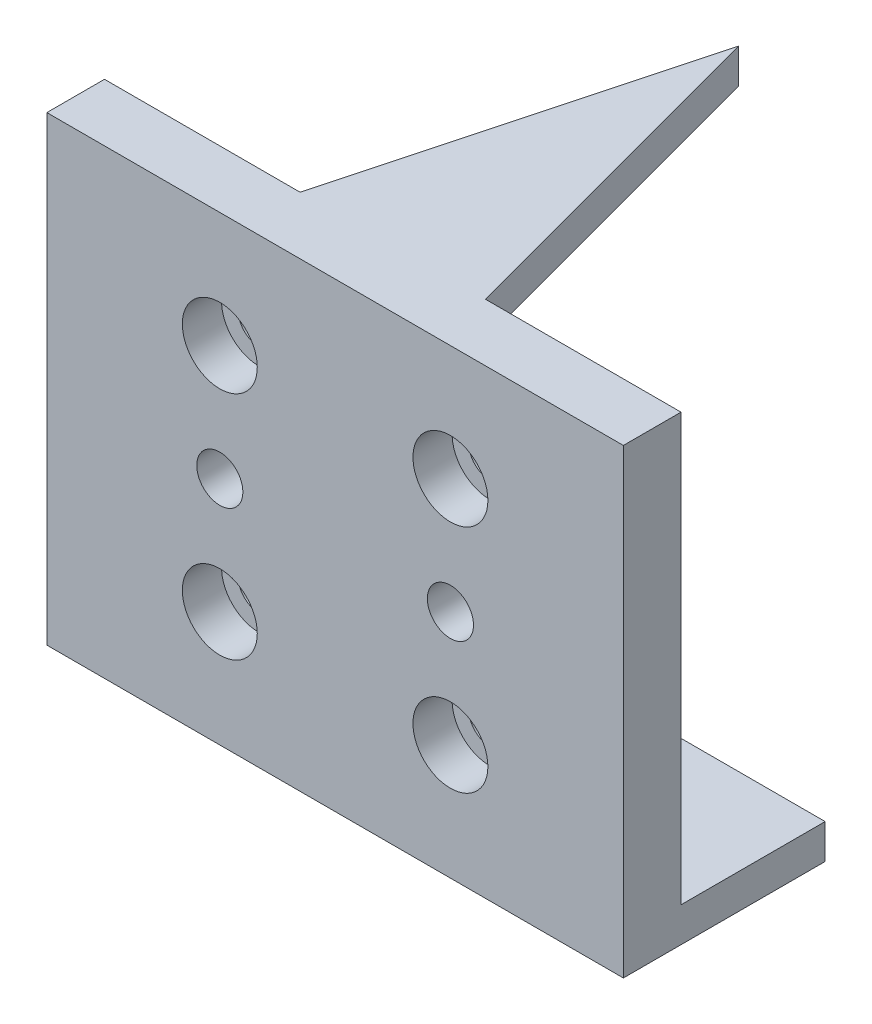
ISO-10303-21;
HEADER;
FILE_DESCRIPTION(('STEP AP214'),'2;1');
FILE_NAME('part.step','',(''),(''),'','','');
FILE_SCHEMA(('AUTOMOTIVE_DESIGN { 1 0 10303 214 1 1 1 1 }'));
ENDSEC;
DATA;
#1=APPLICATION_CONTEXT('core data for automotive mechanical design processes');
#2=APPLICATION_PROTOCOL_DEFINITION('international standard','automotive_design',2000,#1);
#3=PRODUCT_CONTEXT('',#1,'mechanical');
#4=PRODUCT('Part','Part','',(#3));
#5=PRODUCT_RELATED_PRODUCT_CATEGORY('part','',(#4));
#6=PRODUCT_DEFINITION_FORMATION('','',#4);
#7=PRODUCT_DEFINITION_CONTEXT('part definition',#1,'design');
#8=PRODUCT_DEFINITION('design','',#6,#7);
#9=PRODUCT_DEFINITION_SHAPE('','',#8);
#10=(LENGTH_UNIT() NAMED_UNIT(*) SI_UNIT(.MILLI.,.METRE.));
#11=(NAMED_UNIT(*) PLANE_ANGLE_UNIT() SI_UNIT($,.RADIAN.));
#12=(NAMED_UNIT(*) SI_UNIT($,.STERADIAN.) SOLID_ANGLE_UNIT());
#13=UNCERTAINTY_MEASURE_WITH_UNIT(LENGTH_MEASURE(1.E-05),#10,'distance_accuracy_value','');
#14=(GEOMETRIC_REPRESENTATION_CONTEXT(3) GLOBAL_UNCERTAINTY_ASSIGNED_CONTEXT((#13)) GLOBAL_UNIT_ASSIGNED_CONTEXT((#10,
#11,#12)) REPRESENTATION_CONTEXT('',''));
#15=CARTESIAN_POINT('',(0.,0.,0.));
#16=DIRECTION('',(0.,0.,1.));
#17=DIRECTION('',(1.,0.,0.));
#18=AXIS2_PLACEMENT_3D('',#15,#16,#17);
#19=CARTESIAN_POINT('',(0.,0.,0.));
#20=DIRECTION('',(0.,0.,1.));
#21=DIRECTION('',(1.,0.,0.));
#22=AXIS2_PLACEMENT_3D('',#19,#20,#21);
#23=PLANE('',#22);
#24=CARTESIAN_POINT('',(15.,-30.,0.));
#25=DIRECTION('',(0.,0.,1.));
#26=DIRECTION('',(1.,0.,0.));
#27=AXIS2_PLACEMENT_3D('',#24,#25,#26);
#28=CIRCLE('',#27,1.8);
#29=CARTESIAN_POINT('',(16.8,-30.,0.));
#30=VERTEX_POINT('',#29);
#31=EDGE_CURVE('E228',#30,#30,#28,.T.);
#32=ORIENTED_EDGE('',*,*,#31,.T.);
#33=EDGE_LOOP('',(#32));
#34=FACE_BOUND('',#33,.T.);
#35=CARTESIAN_POINT('',(35.,-30.,0.));
#36=DIRECTION('',(0.,0.,1.));
#37=DIRECTION('',(1.,0.,0.));
#38=AXIS2_PLACEMENT_3D('',#35,#36,#37);
#39=CIRCLE('',#38,1.8);
#40=CARTESIAN_POINT('',(36.8,-30.,0.));
#41=VERTEX_POINT('',#40);
#42=EDGE_CURVE('E212',#41,#41,#39,.T.);
#43=ORIENTED_EDGE('',*,*,#42,.T.);
#44=EDGE_LOOP('',(#43));
#45=FACE_BOUND('',#44,.T.);
#46=CARTESIAN_POINT('',(35.,-10.,0.));
#47=DIRECTION('',(0.,0.,1.));
#48=DIRECTION('',(1.,0.,0.));
#49=AXIS2_PLACEMENT_3D('',#46,#47,#48);
#50=CIRCLE('',#49,1.8);
#51=CARTESIAN_POINT('',(36.8,-10.,0.));
#52=VERTEX_POINT('',#51);
#53=EDGE_CURVE('E196',#52,#52,#50,.T.);
#54=ORIENTED_EDGE('',*,*,#53,.T.);
#55=EDGE_LOOP('',(#54));
#56=FACE_BOUND('',#55,.T.);
#57=CARTESIAN_POINT('',(15.,-9.99999999999999,0.));
#58=DIRECTION('',(0.,0.,1.));
#59=DIRECTION('',(1.,0.,0.));
#60=AXIS2_PLACEMENT_3D('',#57,#58,#59);
#61=CIRCLE('',#60,1.8);
#62=CARTESIAN_POINT('',(16.8,-9.99999999999999,0.));
#63=VERTEX_POINT('',#62);
#64=EDGE_CURVE('E180',#63,#63,#61,.T.);
#65=ORIENTED_EDGE('',*,*,#64,.T.);
#66=EDGE_LOOP('',(#65));
#67=FACE_BOUND('',#66,.T.);
#68=CARTESIAN_POINT('',(35.,-20.,0.));
#69=DIRECTION('',(0.,0.,1.));
#70=DIRECTION('',(1.,0.,0.));
#71=AXIS2_PLACEMENT_3D('',#68,#69,#70);
#72=CIRCLE('',#71,2.);
#73=CARTESIAN_POINT('',(37.,-20.,0.));
#74=VERTEX_POINT('',#73);
#75=EDGE_CURVE('E157',#74,#74,#72,.T.);
#76=ORIENTED_EDGE('',*,*,#75,.T.);
#77=EDGE_LOOP('',(#76));
#78=FACE_BOUND('',#77,.T.);
#79=CARTESIAN_POINT('',(15.,-20.,0.));
#80=DIRECTION('',(0.,0.,1.));
#81=DIRECTION('',(1.,0.,0.));
#82=AXIS2_PLACEMENT_3D('',#79,#80,#81);
#83=CIRCLE('',#82,2.);
#84=CARTESIAN_POINT('',(17.,-20.,0.));
#85=VERTEX_POINT('',#84);
#86=EDGE_CURVE('E164',#85,#85,#83,.T.);
#87=ORIENTED_EDGE('',*,*,#86,.T.);
#88=EDGE_LOOP('',(#87));
#89=FACE_BOUND('',#88,.T.);
#90=DIRECTION('',(1.,0.,0.));
#91=VECTOR('',#90,1.);
#92=CARTESIAN_POINT('',(50.,-37.,0.));
#93=LINE('',#92,#91);
#94=CARTESIAN_POINT('',(0.,-37.,0.));
#95=VERTEX_POINT('',#94);
#96=CARTESIAN_POINT('',(50.,-37.,0.));
#97=VERTEX_POINT('',#96);
#98=EDGE_CURVE('E138',#95,#97,#93,.T.);
#99=ORIENTED_EDGE('',*,*,#98,.F.);
#100=DIRECTION('',(0.,-1.,0.));
#101=VECTOR('',#100,1.);
#102=CARTESIAN_POINT('',(0.,0.,0.));
#103=LINE('',#102,#101);
#104=CARTESIAN_POINT('',(0.,0.,0.));
#105=VERTEX_POINT('',#104);
#106=EDGE_CURVE('E253',#105,#95,#103,.T.);
#107=ORIENTED_EDGE('',*,*,#106,.F.);
#108=DIRECTION('',(-1.,0.,0.));
#109=VECTOR('',#108,1.);
#110=CARTESIAN_POINT('',(0.,0.,0.));
#111=LINE('',#110,#109);
#112=CARTESIAN_POINT('',(16.9615242270666,0.,0.));
#113=VERTEX_POINT('',#112);
#114=EDGE_CURVE('E279',#113,#105,#111,.T.);
#115=ORIENTED_EDGE('',*,*,#114,.F.);
#116=DIRECTION('',(0.,1.,0.));
#117=VECTOR('',#116,1.);
#118=CARTESIAN_POINT('',(16.9615242270666,-3.,0.));
#119=LINE('',#118,#117);
#120=CARTESIAN_POINT('',(16.9615242270666,-3.,0.));
#121=VERTEX_POINT('',#120);
#122=EDGE_CURVE('E254',#121,#113,#119,.T.);
#123=ORIENTED_EDGE('',*,*,#122,.F.);
#124=DIRECTION('',(1.,0.,0.));
#125=VECTOR('',#124,1.);
#126=CARTESIAN_POINT('',(33.038475772934,-3.,0.));
#127=LINE('',#126,#125);
#128=CARTESIAN_POINT('',(33.038475772934,-3.,0.));
#129=VERTEX_POINT('',#128);
#130=EDGE_CURVE('E240',#121,#129,#127,.T.);
#131=ORIENTED_EDGE('',*,*,#130,.T.);
#132=DIRECTION('',(0.,1.,0.));
#133=VECTOR('',#132,1.);
#134=CARTESIAN_POINT('',(33.038475772934,-3.,0.));
#135=LINE('',#134,#133);
#136=CARTESIAN_POINT('',(33.038475772934,0.,0.));
#137=VERTEX_POINT('',#136);
#138=EDGE_CURVE('E250',#129,#137,#135,.T.);
#139=ORIENTED_EDGE('',*,*,#138,.T.);
#140=CARTESIAN_POINT('',(50.,0.,0.));
#141=VERTEX_POINT('',#140);
#142=EDGE_CURVE('E264',#141,#137,#111,.T.);
#143=ORIENTED_EDGE('',*,*,#142,.F.);
#144=DIRECTION('',(0.,1.,0.));
#145=VECTOR('',#144,1.);
#146=CARTESIAN_POINT('',(50.,0.,0.));
#147=LINE('',#146,#145);
#148=EDGE_CURVE('E276',#97,#141,#147,.T.);
#149=ORIENTED_EDGE('',*,*,#148,.F.);
#150=EDGE_LOOP('',(#99,#107,#115,#123,#131,#139,#143,#149));
#151=FACE_BOUND('',#150,.T.);
#152=ADVANCED_FACE('F45',(#34,#45,#56,#67,#78,#89,#151),#23,.F.);
#153=CARTESIAN_POINT('',(0.,0.,5.));
#154=DIRECTION('',(1.,0.,0.));
#155=DIRECTION('',(0.,1.,0.));
#156=AXIS2_PLACEMENT_3D('',#153,#154,#155);
#157=PLANE('',#156);
#158=ORIENTED_EDGE('',*,*,#106,.T.);
#159=DIRECTION('',(0.,0.,1.));
#160=VECTOR('',#159,1.);
#161=CARTESIAN_POINT('',(0.,-37.,-12.5));
#162=LINE('',#161,#160);
#163=CARTESIAN_POINT('',(0.,-37.,-12.5));
#164=VERTEX_POINT('',#163);
#165=EDGE_CURVE('E149',#164,#95,#162,.T.);
#166=ORIENTED_EDGE('',*,*,#165,.F.);
#167=DIRECTION('',(0.,1.,0.));
#168=VECTOR('',#167,1.);
#169=CARTESIAN_POINT('',(0.,-40.,-12.5));
#170=LINE('',#169,#168);
#171=CARTESIAN_POINT('',(0.,-40.,-12.5));
#172=VERTEX_POINT('',#171);
#173=EDGE_CURVE('E132',#172,#164,#170,.T.);
#174=ORIENTED_EDGE('',*,*,#173,.F.);
#175=DIRECTION('',(0.,0.,-1.));
#176=VECTOR('',#175,1.);
#177=CARTESIAN_POINT('',(0.,-40.,5.));
#178=LINE('',#177,#176);
#179=CARTESIAN_POINT('',(0.,-40.,5.));
#180=VERTEX_POINT('',#179);
#181=EDGE_CURVE('E11',#180,#172,#178,.T.);
#182=ORIENTED_EDGE('',*,*,#181,.F.);
#183=DIRECTION('',(0.,-1.,0.));
#184=VECTOR('',#183,1.);
#185=CARTESIAN_POINT('',(0.,0.,5.));
#186=LINE('',#185,#184);
#187=CARTESIAN_POINT('',(0.,0.,5.));
#188=VERTEX_POINT('',#187);
#189=EDGE_CURVE('E259',#188,#180,#186,.T.);
#190=ORIENTED_EDGE('',*,*,#189,.F.);
#191=DIRECTION('',(0.,0.,-1.));
#192=VECTOR('',#191,1.);
#193=CARTESIAN_POINT('',(0.,0.,5.));
#194=LINE('',#193,#192);
#195=EDGE_CURVE('E272',#188,#105,#194,.T.);
#196=ORIENTED_EDGE('',*,*,#195,.T.);
#197=EDGE_LOOP('',(#158,#166,#174,#182,#190,#196));
#198=FACE_BOUND('',#197,.T.);
#199=ADVANCED_FACE('F47',(#198),#157,.F.);
#200=CARTESIAN_POINT('',(0.,-40.,5.));
#201=DIRECTION('',(0.,1.,0.));
#202=DIRECTION('',(0.,0.,1.));
#203=AXIS2_PLACEMENT_3D('',#200,#201,#202);
#204=PLANE('',#203);
#205=ORIENTED_EDGE('',*,*,#181,.T.);
#206=DIRECTION('',(-1.,0.,0.));
#207=VECTOR('',#206,1.);
#208=CARTESIAN_POINT('',(50.,-40.,-12.5));
#209=LINE('',#208,#207);
#210=CARTESIAN_POINT('',(50.,-40.,-12.5));
#211=VERTEX_POINT('',#210);
#212=EDGE_CURVE('E126',#211,#172,#209,.T.);
#213=ORIENTED_EDGE('',*,*,#212,.F.);
#214=DIRECTION('',(0.,0.,-1.));
#215=VECTOR('',#214,1.);
#216=CARTESIAN_POINT('',(50.,-40.,5.));
#217=LINE('',#216,#215);
#218=CARTESIAN_POINT('',(50.,-40.,5.));
#219=VERTEX_POINT('',#218);
#220=EDGE_CURVE('E54',#219,#211,#217,.T.);
#221=ORIENTED_EDGE('',*,*,#220,.F.);
#222=DIRECTION('',(1.,0.,0.));
#223=VECTOR('',#222,1.);
#224=CARTESIAN_POINT('',(0.,-40.,5.));
#225=LINE('',#224,#223);
#226=EDGE_CURVE('E263',#180,#219,#225,.T.);
#227=ORIENTED_EDGE('',*,*,#226,.F.);
#228=EDGE_LOOP('',(#205,#213,#221,#227));
#229=FACE_BOUND('',#228,.T.);
#230=ADVANCED_FACE('F127',(#229),#204,.F.);
#231=CARTESIAN_POINT('',(50.,0.,5.));
#232=DIRECTION('',(-1.,0.,0.));
#233=DIRECTION('',(0.,-1.,0.));
#234=AXIS2_PLACEMENT_3D('',#231,#232,#233);
#235=PLANE('',#234);
#236=ORIENTED_EDGE('',*,*,#220,.T.);
#237=DIRECTION('',(0.,-1.,0.));
#238=VECTOR('',#237,1.);
#239=CARTESIAN_POINT('',(50.,-40.,-12.5));
#240=LINE('',#239,#238);
#241=CARTESIAN_POINT('',(50.,-37.,-12.5));
#242=VERTEX_POINT('',#241);
#243=EDGE_CURVE('E119',#242,#211,#240,.T.);
#244=ORIENTED_EDGE('',*,*,#243,.F.);
#245=DIRECTION('',(0.,0.,1.));
#246=VECTOR('',#245,1.);
#247=CARTESIAN_POINT('',(50.,-37.,-12.5));
#248=LINE('',#247,#246);
#249=EDGE_CURVE('E61',#242,#97,#248,.T.);
#250=ORIENTED_EDGE('',*,*,#249,.T.);
#251=ORIENTED_EDGE('',*,*,#148,.T.);
#252=DIRECTION('',(0.,0.,-1.));
#253=VECTOR('',#252,1.);
#254=CARTESIAN_POINT('',(50.,0.,5.));
#255=LINE('',#254,#253);
#256=CARTESIAN_POINT('',(50.,0.,5.));
#257=VERTEX_POINT('',#256);
#258=EDGE_CURVE('E124',#257,#141,#255,.T.);
#259=ORIENTED_EDGE('',*,*,#258,.F.);
#260=DIRECTION('',(0.,1.,0.));
#261=VECTOR('',#260,1.);
#262=CARTESIAN_POINT('',(50.,0.,5.));
#263=LINE('',#262,#261);
#264=EDGE_CURVE('E121',#219,#257,#263,.T.);
#265=ORIENTED_EDGE('',*,*,#264,.F.);
#266=EDGE_LOOP('',(#236,#244,#250,#251,#259,#265));
#267=FACE_BOUND('',#266,.T.);
#268=ADVANCED_FACE('F117',(#267),#235,.F.);
#269=CARTESIAN_POINT('',(0.,0.,5.));
#270=DIRECTION('',(0.,-1.,0.));
#271=DIRECTION('',(0.,0.,-1.));
#272=AXIS2_PLACEMENT_3D('',#269,#270,#271);
#273=PLANE('',#272);
#274=ORIENTED_EDGE('',*,*,#142,.T.);
#275=DIRECTION('',(-0.258819045102531,0.,-0.965925826289065));
#276=VECTOR('',#275,1.);
#277=CARTESIAN_POINT('',(25.,0.,-30.));
#278=LINE('',#277,#276);
#279=CARTESIAN_POINT('',(25.,0.,-30.));
#280=VERTEX_POINT('',#279);
#281=EDGE_CURVE('E69',#137,#280,#278,.T.);
#282=ORIENTED_EDGE('',*,*,#281,.T.);
#283=DIRECTION('',(-0.258819045102511,0.,0.965925826289071));
#284=VECTOR('',#283,1.);
#285=CARTESIAN_POINT('',(25.,0.,-30.));
#286=LINE('',#285,#284);
#287=EDGE_CURVE('E237',#280,#113,#286,.T.);
#288=ORIENTED_EDGE('',*,*,#287,.T.);
#289=ORIENTED_EDGE('',*,*,#114,.T.);
#290=ORIENTED_EDGE('',*,*,#195,.F.);
#291=DIRECTION('',(-1.,0.,0.));
#292=VECTOR('',#291,1.);
#293=CARTESIAN_POINT('',(0.,0.,5.));
#294=LINE('',#293,#292);
#295=EDGE_CURVE('E269',#257,#188,#294,.T.);
#296=ORIENTED_EDGE('',*,*,#295,.F.);
#297=ORIENTED_EDGE('',*,*,#258,.T.);
#298=EDGE_LOOP('',(#274,#282,#288,#289,#290,#296,#297));
#299=FACE_BOUND('',#298,.T.);
#300=ADVANCED_FACE('F291',(#299),#273,.F.);
#301=CARTESIAN_POINT('',(0.,0.,5.));
#302=DIRECTION('',(0.,0.,1.));
#303=DIRECTION('',(1.,0.,0.));
#304=AXIS2_PLACEMENT_3D('',#301,#302,#303);
#305=PLANE('',#304);
#306=CARTESIAN_POINT('',(15.,-20.,5.));
#307=DIRECTION('',(0.,0.,1.));
#308=DIRECTION('',(1.,0.,0.));
#309=AXIS2_PLACEMENT_3D('',#306,#307,#308);
#310=CIRCLE('',#309,2.);
#311=CARTESIAN_POINT('',(17.,-20.,5.));
#312=VERTEX_POINT('',#311);
#313=EDGE_CURVE('E153',#312,#312,#310,.T.);
#314=ORIENTED_EDGE('',*,*,#313,.F.);
#315=EDGE_LOOP('',(#314));
#316=FACE_BOUND('',#315,.T.);
#317=CARTESIAN_POINT('',(35.,-20.,5.));
#318=DIRECTION('',(0.,0.,1.));
#319=DIRECTION('',(1.,0.,0.));
#320=AXIS2_PLACEMENT_3D('',#317,#318,#319);
#321=CIRCLE('',#320,2.);
#322=CARTESIAN_POINT('',(37.,-20.,5.));
#323=VERTEX_POINT('',#322);
#324=EDGE_CURVE('E152',#323,#323,#321,.T.);
#325=ORIENTED_EDGE('',*,*,#324,.F.);
#326=EDGE_LOOP('',(#325));
#327=FACE_BOUND('',#326,.T.);
#328=CARTESIAN_POINT('',(15.,-9.99999999999999,5.));
#329=DIRECTION('',(0.,0.,1.));
#330=DIRECTION('',(1.,0.,0.));
#331=AXIS2_PLACEMENT_3D('',#328,#329,#330);
#332=CIRCLE('',#331,3.25);
#333=CARTESIAN_POINT('',(18.25,-9.99999999999999,5.));
#334=VERTEX_POINT('',#333);
#335=EDGE_CURVE('E168',#334,#334,#332,.T.);
#336=ORIENTED_EDGE('',*,*,#335,.F.);
#337=EDGE_LOOP('',(#336));
#338=FACE_BOUND('',#337,.T.);
#339=CARTESIAN_POINT('',(35.,-10.,5.));
#340=DIRECTION('',(0.,0.,1.));
#341=DIRECTION('',(1.,0.,0.));
#342=AXIS2_PLACEMENT_3D('',#339,#340,#341);
#343=CIRCLE('',#342,3.25);
#344=CARTESIAN_POINT('',(38.25,-10.,5.));
#345=VERTEX_POINT('',#344);
#346=EDGE_CURVE('E184',#345,#345,#343,.T.);
#347=ORIENTED_EDGE('',*,*,#346,.F.);
#348=EDGE_LOOP('',(#347));
#349=FACE_BOUND('',#348,.T.);
#350=CARTESIAN_POINT('',(35.,-30.,5.));
#351=DIRECTION('',(0.,0.,1.));
#352=DIRECTION('',(1.,0.,0.));
#353=AXIS2_PLACEMENT_3D('',#350,#351,#352);
#354=CIRCLE('',#353,3.25);
#355=CARTESIAN_POINT('',(38.25,-30.,5.));
#356=VERTEX_POINT('',#355);
#357=EDGE_CURVE('E200',#356,#356,#354,.T.);
#358=ORIENTED_EDGE('',*,*,#357,.F.);
#359=EDGE_LOOP('',(#358));
#360=FACE_BOUND('',#359,.T.);
#361=CARTESIAN_POINT('',(15.,-30.,5.));
#362=DIRECTION('',(0.,0.,1.));
#363=DIRECTION('',(1.,0.,0.));
#364=AXIS2_PLACEMENT_3D('',#361,#362,#363);
#365=CIRCLE('',#364,3.25);
#366=CARTESIAN_POINT('',(18.25,-30.,5.));
#367=VERTEX_POINT('',#366);
#368=EDGE_CURVE('E216',#367,#367,#365,.T.);
#369=ORIENTED_EDGE('',*,*,#368,.F.);
#370=EDGE_LOOP('',(#369));
#371=FACE_BOUND('',#370,.T.);
#372=ORIENTED_EDGE('',*,*,#189,.T.);
#373=ORIENTED_EDGE('',*,*,#226,.T.);
#374=ORIENTED_EDGE('',*,*,#264,.T.);
#375=ORIENTED_EDGE('',*,*,#295,.T.);
#376=EDGE_LOOP('',(#372,#373,#374,#375));
#377=FACE_BOUND('',#376,.T.);
#378=ADVANCED_FACE('F313',(#316,#327,#338,#349,#360,#371,#377),#305,.T.);
#379=CARTESIAN_POINT('',(25.,-3.,-30.));
#380=DIRECTION('',(0.965925826289065,0.,-0.258819045102531));
#381=DIRECTION('',(-0.258819045102532,0.,-0.965925826289066));
#382=AXIS2_PLACEMENT_3D('',#379,#380,#381);
#383=PLANE('',#382);
#384=ORIENTED_EDGE('',*,*,#281,.F.);
#385=ORIENTED_EDGE('',*,*,#138,.F.);
#386=DIRECTION('',(-0.258819045102531,0.,-0.965925826289065));
#387=VECTOR('',#386,1.);
#388=CARTESIAN_POINT('',(25.,-3.,-30.));
#389=LINE('',#388,#387);
#390=CARTESIAN_POINT('',(25.,-3.,-30.));
#391=VERTEX_POINT('',#390);
#392=EDGE_CURVE('E232',#129,#391,#389,.T.);
#393=ORIENTED_EDGE('',*,*,#392,.T.);
#394=DIRECTION('',(0.,1.,0.));
#395=VECTOR('',#394,1.);
#396=CARTESIAN_POINT('',(25.,-3.,-30.));
#397=LINE('',#396,#395);
#398=EDGE_CURVE('E244',#391,#280,#397,.T.);
#399=ORIENTED_EDGE('',*,*,#398,.T.);
#400=EDGE_LOOP('',(#384,#385,#393,#399));
#401=FACE_BOUND('',#400,.T.);
#402=ADVANCED_FACE('F299',(#401),#383,.T.);
#403=CARTESIAN_POINT('',(25.,-3.,-30.));
#404=DIRECTION('',(-0.965925826289071,0.,-0.258819045102511));
#405=DIRECTION('',(-0.258819045102511,0.,0.965925826289071));
#406=AXIS2_PLACEMENT_3D('',#403,#404,#405);
#407=PLANE('',#406);
#408=ORIENTED_EDGE('',*,*,#287,.F.);
#409=ORIENTED_EDGE('',*,*,#398,.F.);
#410=DIRECTION('',(-0.258819045102511,0.,0.965925826289071));
#411=VECTOR('',#410,1.);
#412=CARTESIAN_POINT('',(25.,-3.,-30.));
#413=LINE('',#412,#411);
#414=EDGE_CURVE('E236',#391,#121,#413,.T.);
#415=ORIENTED_EDGE('',*,*,#414,.T.);
#416=ORIENTED_EDGE('',*,*,#122,.T.);
#417=EDGE_LOOP('',(#408,#409,#415,#416));
#418=FACE_BOUND('',#417,.T.);
#419=ADVANCED_FACE('F305',(#418),#407,.T.);
#420=CARTESIAN_POINT('',(0.,-3.,0.));
#421=DIRECTION('',(0.,-1.,0.));
#422=DIRECTION('',(0.,0.,-1.));
#423=AXIS2_PLACEMENT_3D('',#420,#421,#422);
#424=PLANE('',#423);
#425=ORIENTED_EDGE('',*,*,#392,.F.);
#426=ORIENTED_EDGE('',*,*,#130,.F.);
#427=ORIENTED_EDGE('',*,*,#414,.F.);
#428=EDGE_LOOP('',(#425,#426,#427));
#429=FACE_BOUND('',#428,.T.);
#430=ADVANCED_FACE('F302',(#429),#424,.T.);
#431=CARTESIAN_POINT('',(15.,-30.,5.));
#432=DIRECTION('',(0.,0.,1.));
#433=DIRECTION('',(1.,0.,0.));
#434=AXIS2_PLACEMENT_3D('',#431,#432,#433);
#435=CYLINDRICAL_SURFACE('',#434,1.8);
#436=ORIENTED_EDGE('',*,*,#31,.F.);
#437=EDGE_LOOP('',(#436));
#438=FACE_BOUND('',#437,.T.);
#439=CARTESIAN_POINT('',(15.,-30.,1.6));
#440=DIRECTION('',(0.,0.,1.));
#441=DIRECTION('',(1.,0.,0.));
#442=AXIS2_PLACEMENT_3D('',#439,#440,#441);
#443=CIRCLE('',#442,1.8);
#444=CARTESIAN_POINT('',(16.8,-30.,1.6));
#445=VERTEX_POINT('',#444);
#446=EDGE_CURVE('E224',#445,#445,#443,.T.);
#447=ORIENTED_EDGE('',*,*,#446,.T.);
#448=EDGE_LOOP('',(#447));
#449=FACE_BOUND('',#448,.T.);
#450=ADVANCED_FACE('F533',(#438,#449),#435,.F.);
#451=CARTESIAN_POINT('',(16.8,-30.,1.6));
#452=DIRECTION('',(0.,0.,-1.));
#453=DIRECTION('',(-1.,0.,0.));
#454=AXIS2_PLACEMENT_3D('',#451,#452,#453);
#455=PLANE('',#454);
#456=ORIENTED_EDGE('',*,*,#446,.F.);
#457=EDGE_LOOP('',(#456));
#458=FACE_BOUND('',#457,.T.);
#459=CARTESIAN_POINT('',(15.,-30.,1.6));
#460=DIRECTION('',(0.,0.,1.));
#461=DIRECTION('',(1.,0.,0.));
#462=AXIS2_PLACEMENT_3D('',#459,#460,#461);
#463=CIRCLE('',#462,3.25);
#464=CARTESIAN_POINT('',(18.25,-30.,1.6));
#465=VERTEX_POINT('',#464);
#466=EDGE_CURVE('E220',#465,#465,#463,.T.);
#467=ORIENTED_EDGE('',*,*,#466,.T.);
#468=EDGE_LOOP('',(#467));
#469=FACE_BOUND('',#468,.T.);
#470=ADVANCED_FACE('F522',(#458,#469),#455,.F.);
#471=CARTESIAN_POINT('',(15.,-30.,5.));
#472=DIRECTION('',(0.,0.,1.));
#473=DIRECTION('',(1.,0.,0.));
#474=AXIS2_PLACEMENT_3D('',#471,#472,#473);
#475=CYLINDRICAL_SURFACE('',#474,3.25);
#476=ORIENTED_EDGE('',*,*,#466,.F.);
#477=EDGE_LOOP('',(#476));
#478=FACE_BOUND('',#477,.T.);
#479=ORIENTED_EDGE('',*,*,#368,.T.);
#480=EDGE_LOOP('',(#479));
#481=FACE_BOUND('',#480,.T.);
#482=ADVANCED_FACE('F511',(#478,#481),#475,.F.);
#483=CARTESIAN_POINT('',(35.,-30.,5.));
#484=DIRECTION('',(0.,0.,1.));
#485=DIRECTION('',(1.,0.,0.));
#486=AXIS2_PLACEMENT_3D('',#483,#484,#485);
#487=CYLINDRICAL_SURFACE('',#486,1.8);
#488=ORIENTED_EDGE('',*,*,#42,.F.);
#489=EDGE_LOOP('',(#488));
#490=FACE_BOUND('',#489,.T.);
#491=CARTESIAN_POINT('',(35.,-30.,1.6));
#492=DIRECTION('',(0.,0.,1.));
#493=DIRECTION('',(1.,0.,0.));
#494=AXIS2_PLACEMENT_3D('',#491,#492,#493);
#495=CIRCLE('',#494,1.8);
#496=CARTESIAN_POINT('',(36.8,-30.,1.6));
#497=VERTEX_POINT('',#496);
#498=EDGE_CURVE('E208',#497,#497,#495,.T.);
#499=ORIENTED_EDGE('',*,*,#498,.T.);
#500=EDGE_LOOP('',(#499));
#501=FACE_BOUND('',#500,.T.);
#502=ADVANCED_FACE('F500',(#490,#501),#487,.F.);
#503=CARTESIAN_POINT('',(36.8,-30.,1.6));
#504=DIRECTION('',(0.,0.,-1.));
#505=DIRECTION('',(-1.,0.,0.));
#506=AXIS2_PLACEMENT_3D('',#503,#504,#505);
#507=PLANE('',#506);
#508=ORIENTED_EDGE('',*,*,#498,.F.);
#509=EDGE_LOOP('',(#508));
#510=FACE_BOUND('',#509,.T.);
#511=CARTESIAN_POINT('',(35.,-30.,1.6));
#512=DIRECTION('',(0.,0.,1.));
#513=DIRECTION('',(1.,0.,0.));
#514=AXIS2_PLACEMENT_3D('',#511,#512,#513);
#515=CIRCLE('',#514,3.25);
#516=CARTESIAN_POINT('',(38.25,-30.,1.6));
#517=VERTEX_POINT('',#516);
#518=EDGE_CURVE('E204',#517,#517,#515,.T.);
#519=ORIENTED_EDGE('',*,*,#518,.T.);
#520=EDGE_LOOP('',(#519));
#521=FACE_BOUND('',#520,.T.);
#522=ADVANCED_FACE('F489',(#510,#521),#507,.F.);
#523=CARTESIAN_POINT('',(35.,-30.,5.));
#524=DIRECTION('',(0.,0.,1.));
#525=DIRECTION('',(1.,0.,0.));
#526=AXIS2_PLACEMENT_3D('',#523,#524,#525);
#527=CYLINDRICAL_SURFACE('',#526,3.25);
#528=ORIENTED_EDGE('',*,*,#518,.F.);
#529=EDGE_LOOP('',(#528));
#530=FACE_BOUND('',#529,.T.);
#531=ORIENTED_EDGE('',*,*,#357,.T.);
#532=EDGE_LOOP('',(#531));
#533=FACE_BOUND('',#532,.T.);
#534=ADVANCED_FACE('F478',(#530,#533),#527,.F.);
#535=CARTESIAN_POINT('',(35.,-10.,5.));
#536=DIRECTION('',(0.,0.,1.));
#537=DIRECTION('',(1.,0.,0.));
#538=AXIS2_PLACEMENT_3D('',#535,#536,#537);
#539=CYLINDRICAL_SURFACE('',#538,1.8);
#540=ORIENTED_EDGE('',*,*,#53,.F.);
#541=EDGE_LOOP('',(#540));
#542=FACE_BOUND('',#541,.T.);
#543=CARTESIAN_POINT('',(35.,-10.,1.6));
#544=DIRECTION('',(0.,0.,1.));
#545=DIRECTION('',(1.,0.,0.));
#546=AXIS2_PLACEMENT_3D('',#543,#544,#545);
#547=CIRCLE('',#546,1.8);
#548=CARTESIAN_POINT('',(36.8,-10.,1.6));
#549=VERTEX_POINT('',#548);
#550=EDGE_CURVE('E192',#549,#549,#547,.T.);
#551=ORIENTED_EDGE('',*,*,#550,.T.);
#552=EDGE_LOOP('',(#551));
#553=FACE_BOUND('',#552,.T.);
#554=ADVANCED_FACE('F467',(#542,#553),#539,.F.);
#555=CARTESIAN_POINT('',(36.8,-10.,1.6));
#556=DIRECTION('',(0.,0.,-1.));
#557=DIRECTION('',(-1.,0.,0.));
#558=AXIS2_PLACEMENT_3D('',#555,#556,#557);
#559=PLANE('',#558);
#560=ORIENTED_EDGE('',*,*,#550,.F.);
#561=EDGE_LOOP('',(#560));
#562=FACE_BOUND('',#561,.T.);
#563=CARTESIAN_POINT('',(35.,-10.,1.6));
#564=DIRECTION('',(0.,0.,1.));
#565=DIRECTION('',(1.,0.,0.));
#566=AXIS2_PLACEMENT_3D('',#563,#564,#565);
#567=CIRCLE('',#566,3.25);
#568=CARTESIAN_POINT('',(38.25,-10.,1.6));
#569=VERTEX_POINT('',#568);
#570=EDGE_CURVE('E188',#569,#569,#567,.T.);
#571=ORIENTED_EDGE('',*,*,#570,.T.);
#572=EDGE_LOOP('',(#571));
#573=FACE_BOUND('',#572,.T.);
#574=ADVANCED_FACE('F456',(#562,#573),#559,.F.);
#575=CARTESIAN_POINT('',(35.,-10.,5.));
#576=DIRECTION('',(0.,0.,1.));
#577=DIRECTION('',(1.,0.,0.));
#578=AXIS2_PLACEMENT_3D('',#575,#576,#577);
#579=CYLINDRICAL_SURFACE('',#578,3.25);
#580=ORIENTED_EDGE('',*,*,#570,.F.);
#581=EDGE_LOOP('',(#580));
#582=FACE_BOUND('',#581,.T.);
#583=ORIENTED_EDGE('',*,*,#346,.T.);
#584=EDGE_LOOP('',(#583));
#585=FACE_BOUND('',#584,.T.);
#586=ADVANCED_FACE('F445',(#582,#585),#579,.F.);
#587=CARTESIAN_POINT('',(15.,-9.99999999999999,5.));
#588=DIRECTION('',(0.,0.,1.));
#589=DIRECTION('',(1.,0.,0.));
#590=AXIS2_PLACEMENT_3D('',#587,#588,#589);
#591=CYLINDRICAL_SURFACE('',#590,1.8);
#592=ORIENTED_EDGE('',*,*,#64,.F.);
#593=EDGE_LOOP('',(#592));
#594=FACE_BOUND('',#593,.T.);
#595=CARTESIAN_POINT('',(15.,-9.99999999999999,1.6));
#596=DIRECTION('',(0.,0.,1.));
#597=DIRECTION('',(1.,0.,0.));
#598=AXIS2_PLACEMENT_3D('',#595,#596,#597);
#599=CIRCLE('',#598,1.8);
#600=CARTESIAN_POINT('',(16.8,-9.99999999999999,1.6));
#601=VERTEX_POINT('',#600);
#602=EDGE_CURVE('E176',#601,#601,#599,.T.);
#603=ORIENTED_EDGE('',*,*,#602,.T.);
#604=EDGE_LOOP('',(#603));
#605=FACE_BOUND('',#604,.T.);
#606=ADVANCED_FACE('F434',(#594,#605),#591,.F.);
#607=CARTESIAN_POINT('',(16.8,-9.99999999999999,1.6));
#608=DIRECTION('',(0.,0.,-1.));
#609=DIRECTION('',(-1.,0.,0.));
#610=AXIS2_PLACEMENT_3D('',#607,#608,#609);
#611=PLANE('',#610);
#612=ORIENTED_EDGE('',*,*,#602,.F.);
#613=EDGE_LOOP('',(#612));
#614=FACE_BOUND('',#613,.T.);
#615=CARTESIAN_POINT('',(15.,-9.99999999999999,1.6));
#616=DIRECTION('',(0.,0.,1.));
#617=DIRECTION('',(1.,0.,0.));
#618=AXIS2_PLACEMENT_3D('',#615,#616,#617);
#619=CIRCLE('',#618,3.25);
#620=CARTESIAN_POINT('',(18.25,-9.99999999999999,1.6));
#621=VERTEX_POINT('',#620);
#622=EDGE_CURVE('E172',#621,#621,#619,.T.);
#623=ORIENTED_EDGE('',*,*,#622,.T.);
#624=EDGE_LOOP('',(#623));
#625=FACE_BOUND('',#624,.T.);
#626=ADVANCED_FACE('F423',(#614,#625),#611,.F.);
#627=CARTESIAN_POINT('',(15.,-9.99999999999999,5.));
#628=DIRECTION('',(0.,0.,1.));
#629=DIRECTION('',(1.,0.,0.));
#630=AXIS2_PLACEMENT_3D('',#627,#628,#629);
#631=CYLINDRICAL_SURFACE('',#630,3.25);
#632=ORIENTED_EDGE('',*,*,#622,.F.);
#633=EDGE_LOOP('',(#632));
#634=FACE_BOUND('',#633,.T.);
#635=ORIENTED_EDGE('',*,*,#335,.T.);
#636=EDGE_LOOP('',(#635));
#637=FACE_BOUND('',#636,.T.);
#638=ADVANCED_FACE('F412',(#634,#637),#631,.F.);
#639=CARTESIAN_POINT('',(35.,-20.,-30.));
#640=DIRECTION('',(0.,0.,1.));
#641=DIRECTION('',(1.,0.,0.));
#642=AXIS2_PLACEMENT_3D('',#639,#640,#641);
#643=CYLINDRICAL_SURFACE('',#642,2.);
#644=ORIENTED_EDGE('',*,*,#324,.T.);
#645=EDGE_LOOP('',(#644));
#646=FACE_BOUND('',#645,.T.);
#647=ORIENTED_EDGE('',*,*,#75,.F.);
#648=EDGE_LOOP('',(#647));
#649=FACE_BOUND('',#648,.T.);
#650=ADVANCED_FACE('F401',(#646,#649),#643,.F.);
#651=CARTESIAN_POINT('',(15.,-20.,-30.));
#652=DIRECTION('',(0.,0.,1.));
#653=DIRECTION('',(1.,0.,0.));
#654=AXIS2_PLACEMENT_3D('',#651,#652,#653);
#655=CYLINDRICAL_SURFACE('',#654,2.);
#656=ORIENTED_EDGE('',*,*,#313,.T.);
#657=EDGE_LOOP('',(#656));
#658=FACE_BOUND('',#657,.T.);
#659=ORIENTED_EDGE('',*,*,#86,.F.);
#660=EDGE_LOOP('',(#659));
#661=FACE_BOUND('',#660,.T.);
#662=ADVANCED_FACE('F352',(#658,#661),#655,.F.);
#663=CARTESIAN_POINT('',(50.,-37.,-12.5));
#664=DIRECTION('',(0.,-1.,0.));
#665=DIRECTION('',(0.,0.,-1.));
#666=AXIS2_PLACEMENT_3D('',#663,#664,#665);
#667=PLANE('',#666);
#668=ORIENTED_EDGE('',*,*,#98,.T.);
#669=ORIENTED_EDGE('',*,*,#249,.F.);
#670=DIRECTION('',(1.,0.,0.));
#671=VECTOR('',#670,1.);
#672=CARTESIAN_POINT('',(50.,-37.,-12.5));
#673=LINE('',#672,#671);
#674=EDGE_CURVE('E136',#164,#242,#673,.T.);
#675=ORIENTED_EDGE('',*,*,#674,.F.);
#676=ORIENTED_EDGE('',*,*,#165,.T.);
#677=EDGE_LOOP('',(#668,#669,#675,#676));
#678=FACE_BOUND('',#677,.T.);
#679=ADVANCED_FACE('F349',(#678),#667,.F.);
#680=CARTESIAN_POINT('',(0.,0.,-12.5));
#681=DIRECTION('',(0.,0.,1.));
#682=DIRECTION('',(1.,0.,0.));
#683=AXIS2_PLACEMENT_3D('',#680,#681,#682);
#684=PLANE('',#683);
#685=ORIENTED_EDGE('',*,*,#243,.T.);
#686=ORIENTED_EDGE('',*,*,#212,.T.);
#687=ORIENTED_EDGE('',*,*,#173,.T.);
#688=ORIENTED_EDGE('',*,*,#674,.T.);
#689=EDGE_LOOP('',(#685,#686,#687,#688));
#690=FACE_BOUND('',#689,.T.);
#691=ADVANCED_FACE('F134',(#690),#684,.F.);
#692=CLOSED_SHELL('',(#152,#199,#230,#268,#300,#378,#402,#419,#430,#450,#470,#482,#502,#522,
#534,#554,#574,#586,#606,#626,#638,#650,#662,#679,#691));
#693=MANIFOLD_SOLID_BREP('B2',#692);
#694=ADVANCED_BREP_SHAPE_REPRESENTATION('',(#18,#693),#14);
#695=SHAPE_DEFINITION_REPRESENTATION(#9,#694);
ENDSEC;
END-ISO-10303-21;
